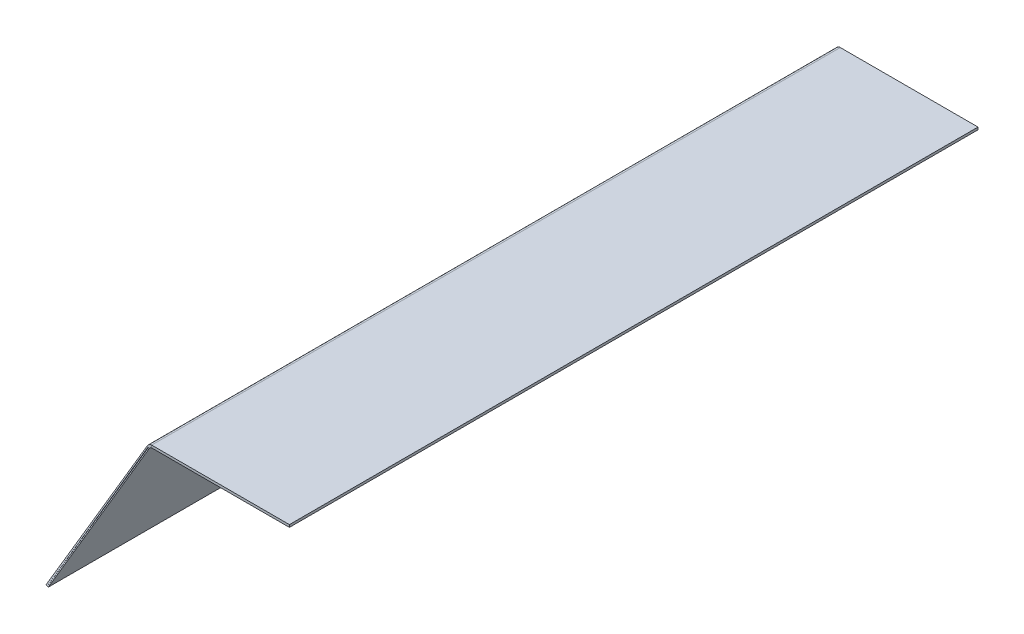
ISO-10303-21;
HEADER;
FILE_DESCRIPTION(('STEP AP214'),'2;1');
FILE_NAME('part.step','',(''),(''),'','','');
FILE_SCHEMA(('AUTOMOTIVE_DESIGN { 1 0 10303 214 1 1 1 1 }'));
ENDSEC;
DATA;
#1=APPLICATION_CONTEXT('core data for automotive mechanical design processes');
#2=APPLICATION_PROTOCOL_DEFINITION('international standard','automotive_design',2000,#1);
#3=PRODUCT_CONTEXT('',#1,'mechanical');
#4=PRODUCT('Part','Part','',(#3));
#5=PRODUCT_RELATED_PRODUCT_CATEGORY('part','',(#4));
#6=PRODUCT_DEFINITION_FORMATION('','',#4);
#7=PRODUCT_DEFINITION_CONTEXT('part definition',#1,'design');
#8=PRODUCT_DEFINITION('design','',#6,#7);
#9=PRODUCT_DEFINITION_SHAPE('','',#8);
#10=(LENGTH_UNIT() NAMED_UNIT(*) SI_UNIT(.MILLI.,.METRE.));
#11=(NAMED_UNIT(*) PLANE_ANGLE_UNIT() SI_UNIT($,.RADIAN.));
#12=(NAMED_UNIT(*) SI_UNIT($,.STERADIAN.) SOLID_ANGLE_UNIT());
#13=UNCERTAINTY_MEASURE_WITH_UNIT(LENGTH_MEASURE(1.E-05),#10,'distance_accuracy_value','');
#14=(GEOMETRIC_REPRESENTATION_CONTEXT(3) GLOBAL_UNCERTAINTY_ASSIGNED_CONTEXT((#13)) GLOBAL_UNIT_ASSIGNED_CONTEXT((#10,
#11,#12)) REPRESENTATION_CONTEXT('',''));
#15=CARTESIAN_POINT('',(0.,0.,0.));
#16=DIRECTION('',(0.,0.,1.));
#17=DIRECTION('',(1.,0.,0.));
#18=AXIS2_PLACEMENT_3D('',#15,#16,#17);
#19=CARTESIAN_POINT('',(-74.4010070551372,31.8162201222626,0.));
#20=DIRECTION('',(0.919457622666744,-0.393189114956173,0.));
#21=DIRECTION('',(0.393189114956173,0.919457622666744,0.));
#22=AXIS2_PLACEMENT_3D('',#19,#20,#21);
#23=PLANE('',#22);
#24=DIRECTION('',(0.,0.,1.));
#25=VECTOR('',#24,1.);
#26=CARTESIAN_POINT('',(-152.379906005456,-150.534435884636,-483.839715405722));
#27=LINE('',#26,#25);
#28=CARTESIAN_POINT('',(-152.379906005456,-150.534435884636,-483.839715405722));
#29=VERTEX_POINT('',#28);
#30=CARTESIAN_POINT('',(-152.379906005456,-150.534435884636,486.160284594278));
#31=VERTEX_POINT('',#30);
#32=EDGE_CURVE('E86',#29,#31,#27,.T.);
#33=ORIENTED_EDGE('',*,*,#32,.T.);
#34=DIRECTION('',(0.369516544423051,0.86410022695852,-0.341743063086704));
#35=VECTOR('',#34,1.);
#36=CARTESIAN_POINT('',(-88.2900802675994,-0.662843389956598,426.887557321551));
#37=LINE('',#36,#35);
#38=CARTESIAN_POINT('',(-88.2900802675994,-0.662843389956598,426.887557321551));
#39=VERTEX_POINT('',#38);
#40=EDGE_CURVE('E97',#31,#39,#37,.T.);
#41=ORIENTED_EDGE('',*,*,#40,.T.);
#42=DIRECTION('',(0.,0.,-1.));
#43=VECTOR('',#42,1.);
#44=CARTESIAN_POINT('',(-88.2900802675993,-0.662843389956709,-424.566988132994));
#45=LINE('',#44,#43);
#46=CARTESIAN_POINT('',(-88.2900802675993,-0.662843389956709,-424.566988132994));
#47=VERTEX_POINT('',#46);
#48=EDGE_CURVE('E82',#39,#47,#45,.T.);
#49=ORIENTED_EDGE('',*,*,#48,.T.);
#50=DIRECTION('',(-0.369516544423051,-0.86410022695852,-0.341743063086704));
#51=VECTOR('',#50,1.);
#52=CARTESIAN_POINT('',(-88.2900802675993,-0.662843389956709,-424.566988132994));
#53=LINE('',#52,#51);
#54=EDGE_CURVE('E14',#47,#29,#53,.T.);
#55=ORIENTED_EDGE('',*,*,#54,.T.);
#56=EDGE_LOOP('',(#33,#41,#49,#55));
#57=FACE_BOUND('',#56,.T.);
#58=ADVANCED_FACE('F77',(#57),#23,.F.);
#59=OPEN_SHELL('',(#58));
#60=SHELL_BASED_SURFACE_MODEL('B2',(#59));
#61=CARTESIAN_POINT('',(0.,0.,1.70234197109191E-13));
#62=DIRECTION('',(0.,1.,0.));
#63=DIRECTION('',(0.,0.,1.));
#64=AXIS2_PLACEMENT_3D('',#61,#62,#63);
#65=PLANE('',#64);
#66=DIRECTION('',(0.,0.,1.));
#67=VECTOR('',#66,1.);
#68=CARTESIAN_POINT('',(-85.,0.,425.));
#69=LINE('',#68,#67);
#70=CARTESIAN_POINT('',(-85.,1.23331324035327E-13,-425.));
#71=VERTEX_POINT('',#70);
#72=CARTESIAN_POINT('',(-85.,0.,425.));
#73=VERTEX_POINT('',#72);
#74=EDGE_CURVE('E124',#71,#73,#69,.T.);
#75=ORIENTED_EDGE('',*,*,#74,.F.);
#76=DIRECTION('',(-1.,0.,0.));
#77=VECTOR('',#76,1.);
#78=CARTESIAN_POINT('',(-85.,0.,-425.));
#79=LINE('',#78,#77);
#80=CARTESIAN_POINT('',(85.,0.,-425.));
#81=VERTEX_POINT('',#80);
#82=EDGE_CURVE('E197',#81,#71,#79,.T.);
#83=ORIENTED_EDGE('',*,*,#82,.F.);
#84=DIRECTION('',(0.,0.,-1.));
#85=VECTOR('',#84,1.);
#86=CARTESIAN_POINT('',(85.,0.,-425.));
#87=LINE('',#86,#85);
#88=CARTESIAN_POINT('',(85.0000000000001,0.,425.));
#89=VERTEX_POINT('',#88);
#90=EDGE_CURVE('E152',#89,#81,#87,.T.);
#91=ORIENTED_EDGE('',*,*,#90,.F.);
#92=DIRECTION('',(1.,0.,0.));
#93=VECTOR('',#92,1.);
#94=CARTESIAN_POINT('',(85.0000000000001,0.,425.));
#95=LINE('',#94,#93);
#96=EDGE_CURVE('E159',#73,#89,#95,.T.);
#97=ORIENTED_EDGE('',*,*,#96,.F.);
#98=EDGE_LOOP('',(#75,#83,#91,#97));
#99=FACE_BOUND('',#98,.T.);
#100=ADVANCED_FACE('F121',(#99),#65,.F.);
#101=CARTESIAN_POINT('',(85.0000000000001,0.,425.));
#102=DIRECTION('',(0.,0.,1.));
#103=DIRECTION('',(1.,0.,0.));
#104=AXIS2_PLACEMENT_3D('',#101,#102,#103);
#105=PLANE('',#104);
#106=ORIENTED_EDGE('',*,*,#96,.T.);
#107=DIRECTION('',(0.,1.,0.));
#108=VECTOR('',#107,1.);
#109=CARTESIAN_POINT('',(85.0000000000002,0.,425.));
#110=LINE('',#109,#108);
#111=CARTESIAN_POINT('',(85.0000000000001,3.,425.));
#112=VERTEX_POINT('',#111);
#113=EDGE_CURVE('E214',#112,#89,#110,.F.);
#114=ORIENTED_EDGE('',*,*,#113,.F.);
#115=DIRECTION('',(1.,0.,0.));
#116=VECTOR('',#115,1.);
#117=CARTESIAN_POINT('',(0.,3.,425.));
#118=LINE('',#117,#116);
#119=CARTESIAN_POINT('',(-85.,3.,425.));
#120=VERTEX_POINT('',#119);
#121=EDGE_CURVE('E220',#120,#112,#118,.T.);
#122=ORIENTED_EDGE('',*,*,#121,.F.);
#123=DIRECTION('',(0.,1.,0.));
#124=VECTOR('',#123,1.);
#125=CARTESIAN_POINT('',(-85.,0.,425.));
#126=LINE('',#125,#124);
#127=EDGE_CURVE('E206',#120,#73,#126,.F.);
#128=ORIENTED_EDGE('',*,*,#127,.T.);
#129=EDGE_LOOP('',(#106,#114,#122,#128));
#130=FACE_BOUND('',#129,.T.);
#131=ADVANCED_FACE('F218',(#130),#105,.T.);
#132=CARTESIAN_POINT('',(85.,0.,-425.));
#133=DIRECTION('',(1.,0.,0.));
#134=DIRECTION('',(0.,0.,-1.));
#135=AXIS2_PLACEMENT_3D('',#132,#133,#134);
#136=PLANE('',#135);
#137=ORIENTED_EDGE('',*,*,#90,.T.);
#138=DIRECTION('',(0.,1.,0.));
#139=VECTOR('',#138,1.);
#140=CARTESIAN_POINT('',(85.,0.,-425.));
#141=LINE('',#140,#139);
#142=CARTESIAN_POINT('',(85.,3.,-425.));
#143=VERTEX_POINT('',#142);
#144=EDGE_CURVE('E139',#143,#81,#141,.F.);
#145=ORIENTED_EDGE('',*,*,#144,.F.);
#146=DIRECTION('',(0.,0.,1.));
#147=VECTOR('',#146,1.);
#148=CARTESIAN_POINT('',(85.0000000000001,3.,1.70234197109191E-13));
#149=LINE('',#148,#147);
#150=EDGE_CURVE('E130',#112,#143,#149,.F.);
#151=ORIENTED_EDGE('',*,*,#150,.F.);
#152=ORIENTED_EDGE('',*,*,#113,.T.);
#153=EDGE_LOOP('',(#137,#145,#151,#152));
#154=FACE_BOUND('',#153,.T.);
#155=ADVANCED_FACE('F268',(#154),#136,.T.);
#156=CARTESIAN_POINT('',(-85.,0.,-425.));
#157=DIRECTION('',(0.,0.,-1.));
#158=DIRECTION('',(-1.,0.,0.));
#159=AXIS2_PLACEMENT_3D('',#156,#157,#158);
#160=PLANE('',#159);
#161=ORIENTED_EDGE('',*,*,#82,.T.);
#162=DIRECTION('',(0.,1.,0.));
#163=VECTOR('',#162,1.);
#164=CARTESIAN_POINT('',(-85.,0.,-425.));
#165=LINE('',#164,#163);
#166=CARTESIAN_POINT('',(-85.,3.00000000000012,-425.));
#167=VERTEX_POINT('',#166);
#168=EDGE_CURVE('E189',#71,#167,#165,.T.);
#169=ORIENTED_EDGE('',*,*,#168,.T.);
#170=DIRECTION('',(1.,0.,0.));
#171=VECTOR('',#170,1.);
#172=CARTESIAN_POINT('',(0.,3.,-425.));
#173=LINE('',#172,#171);
#174=EDGE_CURVE('E75',#143,#167,#173,.F.);
#175=ORIENTED_EDGE('',*,*,#174,.F.);
#176=ORIENTED_EDGE('',*,*,#144,.T.);
#177=EDGE_LOOP('',(#161,#169,#175,#176));
#178=FACE_BOUND('',#177,.T.);
#179=ADVANCED_FACE('F208',(#178),#160,.T.);
#180=CARTESIAN_POINT('',(0.,3.,1.70234197109191E-13));
#181=DIRECTION('',(0.,1.,0.));
#182=DIRECTION('',(0.,0.,1.));
#183=AXIS2_PLACEMENT_3D('',#180,#181,#182);
#184=PLANE('',#183);
#185=ORIENTED_EDGE('',*,*,#150,.T.);
#186=ORIENTED_EDGE('',*,*,#174,.T.);
#187=DIRECTION('',(0.,0.,1.));
#188=VECTOR('',#187,1.);
#189=CARTESIAN_POINT('',(-85.,3.,1.70234197109191E-13));
#190=LINE('',#189,#188);
#191=EDGE_CURVE('E166',#167,#120,#190,.T.);
#192=ORIENTED_EDGE('',*,*,#191,.T.);
#193=ORIENTED_EDGE('',*,*,#121,.T.);
#194=EDGE_LOOP('',(#185,#186,#192,#193));
#195=FACE_BOUND('',#194,.T.);
#196=ADVANCED_FACE('F267',(#195),#184,.T.);
#197=CARTESIAN_POINT('',(-85.,3.02999999999998,425.));
#198=CARTESIAN_POINT('',(-85.5474060731577,3.02999999999998,425.053036906436));
#199=CARTESIAN_POINT('',(-86.0946866329668,2.94961096625254,425.106068022598));
#200=CARTESIAN_POINT('',(-87.1432006777614,2.63480769044957,425.212136045196));
#201=CARTESIAN_POINT('',(-87.6442783192644,2.40043126854226,425.265170056494));
#202=CARTESIAN_POINT('',(-88.557983194433,1.79741700197734,425.371238079092));
#203=CARTESIAN_POINT('',(-88.9705006565159,1.42885160284587,425.424272090391));
#204=CARTESIAN_POINT('',(-89.6722132373853,0.588564593284675,425.530340112989));
#205=CARTESIAN_POINT('',(-89.9613123061872,0.116971403862222,425.58337122915));
#206=CARTESIAN_POINT('',(-90.1765464156137,-0.386345282796699,425.636408135587));
#207=CARTESIAN_POINT('',(-85.,2.99999999999998,425.));
#208=CARTESIAN_POINT('',(-85.5444891623684,2.99999999999998,425.053036905479));
#209=CARTESIAN_POINT('',(-86.0888534892743,2.92003932700075,425.106068022598));
#210=CARTESIAN_POINT('',(-87.131780425482,2.60691351092675,425.212136045196));
#211=CARTESIAN_POINT('',(-87.6301880262665,2.37378598647187,425.265170056494));
#212=CARTESIAN_POINT('',(-88.5390241365585,1.77398493979984,425.371238079092));
#213=CARTESIAN_POINT('',(-88.9493434594119,1.40738347707582,425.424272090391));
#214=CARTESIAN_POINT('',(-89.6473168968663,0.571574018187243,425.530340112989));
#215=CARTESIAN_POINT('',(-89.9348754750789,0.102493754553724,425.583371230107));
#216=CARTESIAN_POINT('',(-90.1489626869337,-0.398140956245384,425.636408135587));
#217=CARTESIAN_POINT('',(-85.,0.,425.));
#218=CARTESIAN_POINT('',(-85.2527980834438,0.,425.053036809763));
#219=CARTESIAN_POINT('',(-85.5055391200202,-0.037124598178232,425.106068022598));
#220=CARTESIAN_POINT('',(-85.9897551975452,-0.182504441355447,425.212136045196));
#221=CARTESIAN_POINT('',(-86.2211587264809,-0.29074222056664,425.265170056494));
#222=CARTESIAN_POINT('',(-86.6431183491165,-0.569221277950081,425.371238079092));
#223=CARTESIAN_POINT('',(-86.8336237490127,-0.739429099929096,425.424272090391));
#224=CARTESIAN_POINT('',(-87.1576828449737,-1.12748349155593,425.530340112989));
#225=CARTESIAN_POINT('',(-87.2911923642417,-1.34527117629606,425.583371325823));
#226=CARTESIAN_POINT('',(-87.3905898189335,-1.57770830111394,425.636408135587));
#227=CARTESIAN_POINT('',(-85.,-0.0303000000000178,425.));
#228=CARTESIAN_POINT('',(-85.2498520035467,-0.0303000000000191,425.053036808796));
#229=CARTESIAN_POINT('',(-85.4996476448907,-0.0669919538225398,425.106068022598));
#230=CARTESIAN_POINT('',(-85.978220742743,-0.210677562673497,425.212136045196));
#231=CARTESIAN_POINT('',(-86.206927530553,-0.317653955457729,425.265170056494));
#232=CARTESIAN_POINT('',(-86.6239697006633,-0.592887660749356,425.371238079092));
#233=CARTESIAN_POINT('',(-86.8122549799376,-0.761111906956845,425.424272090391));
#234=CARTESIAN_POINT('',(-87.1325375410495,-1.14464397240434,425.530340112989));
#235=CARTESIAN_POINT('',(-87.2644911648222,-1.35989360209765,425.58337132679));
#236=CARTESIAN_POINT('',(-87.3627302529667,-1.58962193129711,425.636408135587));
#237=B_SPLINE_SURFACE_WITH_KNOTS('',1,3,((#197,#198,#199,#200,#201,#202,#203,#204,#205,#206),
(#207,#208,#209,#210,#211,#212,#213,#214,#215,#216),(#217,#218,#219,#220,#221,#222,#223,#224,
#225,#226),(#227,#228,#229,#230,#231,#232,#233,#234,#235,#236)),.UNSPECIFIED.,.F.,.F.,.F.,(2,1,
1,2),(4,2,2,2,4),(-0.01,0.,1.,1.0101),(0.,0.25,0.5,0.75,1.),.UNSPECIFIED.);
#238=DIRECTION('',(0.919457622666744,-0.393189114956173,0.));
#239=VECTOR('',#238,1.);
#240=CARTESIAN_POINT('',(-90.1489626869338,-0.398140956245424,425.636408135587));
#241=LINE('',#240,#239);
#242=CARTESIAN_POINT('',(-87.3905898189335,-1.57770830111397,425.636408135587));
#243=VERTEX_POINT('',#242);
#244=CARTESIAN_POINT('',(-90.1489626869338,-0.398140956245455,425.636408135587));
#245=VERTEX_POINT('',#244);
#246=EDGE_CURVE('E225',#243,#245,#241,.F.);
#247=CARTESIAN_POINT('',(-85.,0.,425.));
#248=CARTESIAN_POINT('',(-85.0315981027957,2.74792040034967E-07,425.006629251412));
#249=CARTESIAN_POINT('',(-85.0631961882308,-0.000576012961313448,425.013258502825));
#250=CARTESIAN_POINT('',(-85.1263503702388,-0.0028797408908729,425.026517005649));
#251=CARTESIAN_POINT('',(-85.1579064668117,-0.00460718106707852,425.033146257062));
#252=CARTESIAN_POINT('',(-85.2209347169546,-0.00921124117437272,425.046404759886));
#253=CARTESIAN_POINT('',(-85.2524068705245,-0.0120878611054616,425.053034011299));
#254=CARTESIAN_POINT('',(-85.3152254070461,-0.0189863706657483,425.066292514124));
#255=CARTESIAN_POINT('',(-85.3465717899978,-0.0230082602949461,425.072921765536));
#256=CARTESIAN_POINT('',(-85.4090971208272,-0.0321919868271877,425.086180268361));
#257=CARTESIAN_POINT('',(-85.4402760687048,-0.037353823730231,425.092809519773));
#258=CARTESIAN_POINT('',(-85.5024250885478,-0.04881057780612,425.106068022598));
#259=CARTESIAN_POINT('',(-85.5333951605132,-0.0551054949789661,425.11269727401));
#260=CARTESIAN_POINT('',(-85.5950852650303,-0.0688200444595399,425.125955776835));
#261=CARTESIAN_POINT('',(-85.6258052975821,-0.0762396767672677,425.132585028247));
#262=CARTESIAN_POINT('',(-85.686954492184,-0.092193794369885,425.145843531072));
#263=CARTESIAN_POINT('',(-85.7173836542343,-0.100728279664774,425.152472782484));
#264=CARTESIAN_POINT('',(-85.7779106633312,-0.118900759868904,425.165731285309));
#265=CARTESIAN_POINT('',(-85.8080085103778,-0.128538754778146,425.172360536721));
#266=CARTESIAN_POINT('',(-85.8678328853338,-0.148905443971971,425.185619039546));
#267=CARTESIAN_POINT('',(-85.8975594132431,-0.159634138256556,425.192248290958));
#268=CARTESIAN_POINT('',(-85.9566016393228,-0.182167966314828,425.205506793783));
#269=CARTESIAN_POINT('',(-85.9859173374932,-0.193973100088515,425.212136045196));
#270=CARTESIAN_POINT('',(-86.0440989395425,-0.218644116493245,425.22539454802));
#271=CARTESIAN_POINT('',(-86.0729648434214,-0.231509999124288,425.232023799433));
#272=CARTESIAN_POINT('',(-86.1302084901729,-0.258285412735336,425.245282302257));
#273=CARTESIAN_POINT('',(-86.1585862330454,-0.27219494371534,425.25191155367));
#274=CARTESIAN_POINT('',(-86.2148158399018,-0.301039166364421,425.265170056494));
#275=CARTESIAN_POINT('',(-86.2426677038856,-0.315973858033499,425.271799307907));
#276=CARTESIAN_POINT('',(-86.2978085340467,-0.346848551822972,425.285057810731));
#277=CARTESIAN_POINT('',(-86.325097500224,-0.362788553943368,425.291687062144));
#278=CARTESIAN_POINT('',(-86.3790762640221,-0.39565268220327,425.304945564969));
#279=CARTESIAN_POINT('',(-86.4057660616429,-0.412576808342777,425.311574816381));
#280=CARTESIAN_POINT('',(-86.4585110139545,-0.447386690173942,425.324833319206));
#281=CARTESIAN_POINT('',(-86.4845661686453,-0.465272445865601,425.331462570618));
#282=CARTESIAN_POINT('',(-86.5360072042503,-0.50198181419754,425.344721073443));
#283=CARTESIAN_POINT('',(-86.5613930851646,-0.520805426837822,425.351350324855));
#284=CARTESIAN_POINT('',(-86.6114618319258,-0.559365489924004,425.36460882768));
#285=CARTESIAN_POINT('',(-86.6361446977728,-0.579101940369903,425.371238079092));
#286=CARTESIAN_POINT('',(-86.6847746075116,-0.619461446638565,425.384496581917));
#287=CARTESIAN_POINT('',(-86.7087216514034,-0.640084502461327,425.391125833329));
#288=CARTESIAN_POINT('',(-86.7558480883512,-0.68218980863587,425.404384336154));
#289=CARTESIAN_POINT('',(-86.7790274814072,-0.70367205898765,425.411013587566));
#290=CARTESIAN_POINT('',(-86.8245878081159,-0.747467201385584,425.424272090391));
#291=CARTESIAN_POINT('',(-86.8469687417687,-0.769780093431738,425.430901341803));
#292=CARTESIAN_POINT('',(-86.8909024023621,-0.815206862349143,425.444159844628));
#293=CARTESIAN_POINT('',(-86.9124551293027,-0.838320739220394,425.450789096041));
#294=CARTESIAN_POINT('',(-86.9547037299722,-0.885318756296246,425.464047598865));
#295=CARTESIAN_POINT('',(-86.975399603701,-0.909202896500846,425.470676850278));
#296=CARTESIAN_POINT('',(-87.0159069902853,-0.957709694984185,425.483935353102));
#297=CARTESIAN_POINT('',(-87.0357185031406,-0.982332353262924,425.490564604515));
#298=CARTESIAN_POINT('',(-87.074430835889,-1.03228346097955,425.503823107339));
#299=CARTESIAN_POINT('',(-87.0933316557822,-1.05761191041743,425.510452358752));
#300=CARTESIAN_POINT('',(-87.1301974804402,-1.10894093568651,425.523710861577));
#301=CARTESIAN_POINT('',(-87.148162485205,-1.1349415115177,425.530340112989));
#302=CARTESIAN_POINT('',(-87.1831328031786,-1.18758023055826,425.543598615814));
#303=CARTESIAN_POINT('',(-87.2001381163873,-1.21421837376763,425.550227867226));
#304=CARTESIAN_POINT('',(-87.233166443243,-1.26809682450122,425.563486370051));
#305=CARTESIAN_POINT('',(-87.24918945689,-1.29533713202545,425.570115621463));
#306=CARTESIAN_POINT('',(-87.280231908868,-1.3503836954065,425.583374124288));
#307=CARTESIAN_POINT('',(-87.2952513471991,-1.37818995126333,425.5900033757));
#308=CARTESIAN_POINT('',(-87.3242666072509,-1.43433148998172,425.603261878525));
#309=CARTESIAN_POINT('',(-87.3382624289715,-1.46266677284329,425.609891129937));
#310=CARTESIAN_POINT('',(-87.3652121461064,-1.51982856614811,425.623149632762));
#311=CARTESIAN_POINT('',(-87.3781660415206,-1.54865507659136,425.629778884174));
#312=CARTESIAN_POINT('',(-87.3905898189335,-1.57770830111394,425.636408135587));
#313=B_SPLINE_CURVE_WITH_KNOTS('',3,(#247,#248,#249,#250,#251,#252,#253,#254,#255,#256,#257,
#258,#259,#260,#261,#262,#263,#264,#265,#266,#267,#268,#269,#270,#271,#272,#273,#274,#275,#276,
#277,#278,#279,#280,#281,#282,#283,#284,#285,#286,#287,#288,#289,#290,#291,#292,#293,#294,#295,
#296,#297,#298,#299,#300,#301,#302,#303,#304,#305,#306,#307,#308,#309,#310,#311,#312),
.UNSPECIFIED.,.F.,.F.,(4,2,2,2,2,2,2,2,2,2,2,2,2,2,2,2,2,2,2,2,2,2,2,2,2,2,2,2,2,2,2,2,4),(0.,
0.096852892492617,0.193705784985204,0.290558677477816,0.387411569970432,0.484264462463015,
0.581117354955632,0.677970247448268,0.774823139940862,0.871676032433449,0.968528924926082,
1.06538181741867,1.16223470991129,1.25908760240389,1.35594049489649,1.45279338738913,
1.54964627988172,1.64649917237431,1.74335206486694,1.84020495735953,1.93705784985214,
2.03391074234476,2.13076363483735,2.22761652732996,2.32446941982257,2.42132231231518,
2.5181752048078,2.61502809730039,2.711880989793,2.80873388228561,2.90558677477823,
3.00243966727082,3.09929255976343),.UNSPECIFIED.);
#314=EDGE_CURVE('E202',#73,#243,#313,.T.);
#315=CARTESIAN_POINT('',(-85.,2.99999999999998,425.));
#316=CARTESIAN_POINT('',(-85.0680574521754,3.0000005918598,425.006629251412));
#317=CARTESIAN_POINT('',(-85.1361148669587,2.99875935669873,425.013258502825));
#318=CARTESIAN_POINT('',(-85.2721392589759,2.99379748115814,425.026517005649));
#319=CARTESIAN_POINT('',(-85.3401062362099,2.99007684077862,425.033146257062));
#320=CARTESIAN_POINT('',(-85.4758593903637,2.98016040362445,425.046404759886));
#321=CARTESIAN_POINT('',(-85.5436455672836,2.9739646068498,425.053034011299));
#322=CARTESIAN_POINT('',(-85.6789470305609,2.9591062785661,425.066292514124));
#323=CARTESIAN_POINT('',(-85.7464623169184,2.95044374705706,425.072921765536));
#324=CARTESIAN_POINT('',(-85.8811322602432,2.93066341298762,425.086180268361));
#325=CARTESIAN_POINT('',(-85.9482869172104,2.91954561042722,425.092809519773));
#326=CARTESIAN_POINT('',(-86.0821463445646,2.8948695247253,425.106068022598));
#327=CARTESIAN_POINT('',(-86.1488511149516,2.88131124158379,425.11269727401));
#328=CARTESIAN_POINT('',(-86.2817221092961,2.85177221193332,425.125955776835));
#329=CARTESIAN_POINT('',(-86.3478883332537,2.83579146542436,425.132585028247));
#330=CARTESIAN_POINT('',(-86.4795942908579,2.80142875058796,425.145843531072));
#331=CARTESIAN_POINT('',(-86.5451340245045,2.7830467822605,425.152472782484));
#332=CARTESIAN_POINT('',(-86.6754998902517,2.743906055667,425.165731285309));
#333=CARTESIAN_POINT('',(-86.7403260223522,2.72314729740094,425.172360536721));
#334=CARTESIAN_POINT('',(-86.8691785222574,2.67928058221424,425.185619039546));
#335=CARTESIAN_POINT('',(-86.9332048900621,2.65617262529359,425.192248290958));
#336=CARTESIAN_POINT('',(-87.0603727616185,2.60763822639885,425.205506793783));
#337=CARTESIAN_POINT('',(-87.1235142653701,2.58221178442476,425.212136045196));
#338=CARTESIAN_POINT('',(-87.2488284851685,2.52907421062996,425.22539454802));
#339=CARTESIAN_POINT('',(-87.3110012012154,2.50136307880924,425.232023799433));
#340=CARTESIAN_POINT('',(-87.4342952096031,2.44369295718545,425.245282302257));
#341=CARTESIAN_POINT('',(-87.495416501944,2.41373396738237,425.25191155367));
#342=CARTESIAN_POINT('',(-87.6165264244039,2.35160794936896,425.265170056494));
#343=CARTESIAN_POINT('',(-87.6765150545229,2.31944092115864,425.271799307907));
#344=CARTESIAN_POINT('',(-87.7952799194853,2.25294158068901,425.285057810731));
#345=CARTESIAN_POINT('',(-87.8540561543287,2.21860926842969,425.291687062144));
#346=CARTESIAN_POINT('',(-87.9703181071245,2.14782499217759,425.304945564969));
#347=CARTESIAN_POINT('',(-88.027803825077,2.1113730281848,425.311574816381));
#348=CARTESIAN_POINT('',(-88.1414083377481,2.03639789808692,425.324833319206));
#349=CARTESIAN_POINT('',(-88.1975271324667,1.99787473198181,425.331462570618));
#350=CARTESIAN_POINT('',(-88.3083232091546,1.91880840018994,425.344721073443));
#351=CARTESIAN_POINT('',(-88.3630004911237,1.87826523450317,425.351350324855));
#352=CARTESIAN_POINT('',(-88.4708408687633,1.79521279093293,425.36460882768));
#353=CARTESIAN_POINT('',(-88.5240039644337,1.75270351304946,425.371238079092));
#354=CARTESIAN_POINT('',(-88.6287453084865,1.66577534570158,425.384496581917));
#355=CARTESIAN_POINT('',(-88.6803235568688,1.62135645623717,425.391125833329));
#356=CARTESIAN_POINT('',(-88.7818266518333,1.53066810447661,425.404384336154));
#357=CARTESIAN_POINT('',(-88.8317514984155,1.48439864218046,425.411013587566));
#358=CARTESIAN_POINT('',(-88.9298814328651,1.39007064316953,425.424272090391));
#359=CARTESIAN_POINT('',(-88.9780865207325,1.34201210645474,425.430901341803));
#360=CARTESIAN_POINT('',(-89.072712866626,1.24416983494034,425.444159844628));
#361=CARTESIAN_POINT('',(-89.1191341246519,1.19438610014072,425.450789096041));
#362=CARTESIAN_POINT('',(-89.2101311107093,1.09315960182349,425.464047598865));
#363=CARTESIAN_POINT('',(-89.2547068387407,1.04171683830589,425.470676850278));
#364=CARTESIAN_POINT('',(-89.3419535175375,0.937240656957166,425.483935353102));
#365=CARTESIAN_POINT('',(-89.3846244683028,0.884207239126039,425.490564604515));
#366=CARTESIAN_POINT('',(-89.4680048772995,0.776620237890228,425.503823107339));
#367=CARTESIAN_POINT('',(-89.5087143355309,0.722066654485544,425.510452358752));
#368=CARTESIAN_POINT('',(-89.5881176501789,0.61151183082907,425.523710861577));
#369=CARTESIAN_POINT('',(-89.6268115065955,0.555510590577281,425.530340112989));
#370=CARTESIAN_POINT('',(-89.7021321914616,0.442134888028387,425.543598615814));
#371=CARTESIAN_POINT('',(-89.7387590199112,0.384760425731281,425.550227867226));
#372=CARTESIAN_POINT('',(-89.8098969546773,0.268714531843544,425.563486370051));
#373=CARTESIAN_POINT('',(-89.8444080609938,0.210043100252912,425.570115621463));
#374=CARTESIAN_POINT('',(-89.9112687267926,0.0914812714321782,425.583374124288));
#375=CARTESIAN_POINT('',(-89.9436182862749,0.0315908742020766,425.5900033757));
#376=CARTESIAN_POINT('',(-90.0061126925403,-0.0893293630375388,425.603261878525));
#377=CARTESIAN_POINT('',(-90.0362575393233,-0.150359203047052,425.609891129937));
#378=CARTESIAN_POINT('',(-90.0943030839215,-0.273476911703577,425.623149632762));
#379=CARTESIAN_POINT('',(-90.1222037817367,-0.335564780350587,425.629778884174));
#380=CARTESIAN_POINT('',(-90.1489626869337,-0.398140956245384,425.636408135587));
#381=B_SPLINE_CURVE_WITH_KNOTS('',3,(#315,#316,#317,#318,#319,#320,#321,#322,#323,#324,#325,
#326,#327,#328,#329,#330,#331,#332,#333,#334,#335,#336,#337,#338,#339,#340,#341,#342,#343,#344,
#345,#346,#347,#348,#349,#350,#351,#352,#353,#354,#355,#356,#357,#358,#359,#360,#361,#362,#363,
#364,#365,#366,#367,#368,#369,#370,#371,#372,#373,#374,#375,#376,#377,#378,#379,#380),
.UNSPECIFIED.,.F.,.F.,(4,2,2,2,2,2,2,2,2,2,2,2,2,2,2,2,2,2,2,2,2,2,2,2,2,2,2,2,2,2,2,2,4),(0.,
0.205127352563989,0.410254705127977,0.615382057691963,0.820509410255951,1.02563676281994,
1.23076411538393,1.43589146794793,1.6410188205119,1.84614617307589,2.05127352563989,
2.25640087820386,2.46152823076786,2.66665558333185,2.87178293589583,3.07691028845983,
3.28203764102381,3.48716499358779,3.6922923461518,3.89741969871577,4.10254705127976,
4.30767440384375,4.51280175640773,4.71792910897172,4.92305646153571,5.12818381409971,
5.3333111666637,5.53843851922768,5.74356587179167,5.94869322435566,6.15382057691965,
6.35894792948363,6.56407528204762),.UNSPECIFIED.);
#382=EDGE_CURVE('E207',#120,#245,#381,.T.);
#383=ORIENTED_EDGE('',*,*,#246,.F.);
#384=ORIENTED_EDGE('',*,*,#314,.F.);
#385=ORIENTED_EDGE('',*,*,#127,.F.);
#386=ORIENTED_EDGE('',*,*,#382,.T.);
#387=EDGE_LOOP('',(#383,#384,#385,#386));
#388=FACE_BOUND('',#387,.T.);
#389=ADVANCED_FACE('F223',(#388),#237,.F.);
#390=CARTESIAN_POINT('',(-90.1765464156138,-0.386345282796603,-425.61226127099));
#391=CARTESIAN_POINT('',(-89.9613122980905,0.116971422796239,-425.561236711234));
#392=CARTESIAN_POINT('',(-89.6722132373853,0.588564593284788,-425.510217725825));
#393=CARTESIAN_POINT('',(-88.9705006565159,1.428851602846,-425.40817418066));
#394=CARTESIAN_POINT('',(-88.5579831944329,1.79741700197749,-425.357152408077));
#395=CARTESIAN_POINT('',(-87.6442783192643,2.40043126854241,-425.255108862912));
#396=CARTESIAN_POINT('',(-87.1432006777613,2.63480769044972,-425.20408709033));
#397=CARTESIAN_POINT('',(-86.0946866329668,2.94961096625269,-425.102043545165));
#398=CARTESIAN_POINT('',(-85.5474060937501,3.03000000000013,-425.051024559756));
#399=CARTESIAN_POINT('',(-85.,3.03000000000012,-425.));
#400=CARTESIAN_POINT('',(-90.1489626869338,-0.398140956245289,-425.61226127099));
#401=CARTESIAN_POINT('',(-89.9348754668988,0.102493773682598,-425.56123671209));
#402=CARTESIAN_POINT('',(-89.6473168968664,0.571574018187356,-425.510217725825));
#403=CARTESIAN_POINT('',(-88.9493434594119,1.40738347707595,-425.40817418066));
#404=CARTESIAN_POINT('',(-88.5390241365585,1.77398493979999,-425.357152408077));
#405=CARTESIAN_POINT('',(-87.6301880262665,2.37378598647203,-425.255108862912));
#406=CARTESIAN_POINT('',(-87.131780425482,2.6069135109269,-425.20408709033));
#407=CARTESIAN_POINT('',(-86.0888534892743,2.9200393270009,-425.102043545165));
#408=CARTESIAN_POINT('',(-85.5444891831728,3.00000000000013,-425.0510245589));
#409=CARTESIAN_POINT('',(-85.,3.00000000000012,-425.));
#410=CARTESIAN_POINT('',(-87.3905898189335,-1.57770830111382,-425.61226127099));
#411=CARTESIAN_POINT('',(-87.2911923477289,-1.34527113768145,-425.561236797647));
#412=CARTESIAN_POINT('',(-87.1576828449737,-1.1274834915558,-425.510217725825));
#413=CARTESIAN_POINT('',(-86.8336237490127,-0.739429099928958,-425.40817418066));
#414=CARTESIAN_POINT('',(-86.6431183491164,-0.56922127794994,-425.357152408077));
#415=CARTESIAN_POINT('',(-86.2211587264809,-0.290742220566494,-425.255108862912));
#416=CARTESIAN_POINT('',(-85.9897551975452,-0.182504441355301,-425.20408709033));
#417=CARTESIAN_POINT('',(-85.5055391200202,-0.0371245981780866,-425.102043545165));
#418=CARTESIAN_POINT('',(-85.2527981254407,1.24521026812854E-13,-425.051024473343));
#419=CARTESIAN_POINT('',(-85.,1.23165366794353E-13,-425.));
#420=CARTESIAN_POINT('',(-87.3627302529667,-1.58962193129699,-425.61226127099));
#421=CARTESIAN_POINT('',(-87.2644911482253,-1.35989356328623,-425.561236798511));
#422=CARTESIAN_POINT('',(-87.1325375410496,-1.14464397240421,-425.510217725825));
#423=CARTESIAN_POINT('',(-86.8122549799376,-0.761111906956708,-425.40817418066));
#424=CARTESIAN_POINT('',(-86.6239697006633,-0.592887660749215,-425.357152408077));
#425=CARTESIAN_POINT('',(-86.206927530553,-0.317653955457583,-425.255108862912));
#426=CARTESIAN_POINT('',(-85.978220742743,-0.210677562673351,-425.20408709033));
#427=CARTESIAN_POINT('',(-85.4996476448907,-0.0669919538223943,-425.102043545165));
#428=CARTESIAN_POINT('',(-85.2498520457576,-0.0302999999998755,-425.051024472479));
#429=CARTESIAN_POINT('',(-85.,-0.0302999999998768,-425.));
#430=B_SPLINE_SURFACE_WITH_KNOTS('',1,3,((#390,#391,#392,#393,#394,#395,#396,#397,#398,#399),
(#400,#401,#402,#403,#404,#405,#406,#407,#408,#409),(#410,#411,#412,#413,#414,#415,#416,#417,
#418,#419),(#420,#421,#422,#423,#424,#425,#426,#427,#428,#429)),.UNSPECIFIED.,.F.,.F.,.F.,(2,1,
1,2),(4,2,2,2,4),(-0.01,0.,1.,1.0101),(0.,0.25,0.5,0.75,1.),.UNSPECIFIED.);
#431=CARTESIAN_POINT('',(-87.3905898189335,-1.57770830111382,-425.61226127099));
#432=CARTESIAN_POINT('',(-87.3781660415206,-1.54865507659123,-425.605883549417));
#433=CARTESIAN_POINT('',(-87.3652121461064,-1.51982856614798,-425.599505827844));
#434=CARTESIAN_POINT('',(-87.3382624289715,-1.46266677284316,-425.586750384699));
#435=CARTESIAN_POINT('',(-87.3242666072509,-1.43433148998161,-425.580372663126));
#436=CARTESIAN_POINT('',(-87.2952513471991,-1.37818995126321,-425.56761721998));
#437=CARTESIAN_POINT('',(-87.280231908868,-1.35038369540637,-425.561239498407));
#438=CARTESIAN_POINT('',(-87.24918945689,-1.29533713202532,-425.548484055262));
#439=CARTESIAN_POINT('',(-87.233166443243,-1.2680968245011,-425.542106333689));
#440=CARTESIAN_POINT('',(-87.2001381163873,-1.2142183737675,-425.529350890543));
#441=CARTESIAN_POINT('',(-87.1831328031786,-1.18758023055813,-425.522973168971));
#442=CARTESIAN_POINT('',(-87.148162485205,-1.13494151151757,-425.510217725825));
#443=CARTESIAN_POINT('',(-87.1301974804402,-1.10894093568639,-425.503840004252));
#444=CARTESIAN_POINT('',(-87.0933316557822,-1.05761191041731,-425.491084561107));
#445=CARTESIAN_POINT('',(-87.074430835889,-1.03228346097942,-425.484706839534));
#446=CARTESIAN_POINT('',(-87.0357185031406,-0.982332353262787,-425.471951396388));
#447=CARTESIAN_POINT('',(-87.0159069902853,-0.95770969498405,-425.465573674815));
#448=CARTESIAN_POINT('',(-86.9753996037011,-0.909202896500713,-425.45281823167));
#449=CARTESIAN_POINT('',(-86.9547037299722,-0.885318756296112,-425.446440510097));
#450=CARTESIAN_POINT('',(-86.9124551293027,-0.838320739220258,-425.433685066951));
#451=CARTESIAN_POINT('',(-86.8909024023621,-0.815206862349005,-425.427307345378));
#452=CARTESIAN_POINT('',(-86.8469687417687,-0.769780093431599,-425.414551902233));
#453=CARTESIAN_POINT('',(-86.8245878081159,-0.747467201385447,-425.40817418066));
#454=CARTESIAN_POINT('',(-86.7790274814072,-0.703672058987514,-425.395418737514));
#455=CARTESIAN_POINT('',(-86.7558480883512,-0.682189808635734,-425.389041015941));
#456=CARTESIAN_POINT('',(-86.7087216514034,-0.640084502461187,-425.376285572796));
#457=CARTESIAN_POINT('',(-86.6847746075116,-0.61946144663842,-425.369907851223));
#458=CARTESIAN_POINT('',(-86.6361446977728,-0.579101940369761,-425.357152408077));
#459=CARTESIAN_POINT('',(-86.6114618319258,-0.559365489923869,-425.350774686505));
#460=CARTESIAN_POINT('',(-86.5613930851646,-0.520805426837685,-425.338019243359));
#461=CARTESIAN_POINT('',(-86.5360072042503,-0.501981814197393,-425.331641521786));
#462=CARTESIAN_POINT('',(-86.4845661686453,-0.46527244586545,-425.318886078641));
#463=CARTESIAN_POINT('',(-86.4585110139544,-0.4473866901738,-425.312508357068));
#464=CARTESIAN_POINT('',(-86.4057660616429,-0.41257680834264,-425.299752913922));
#465=CARTESIAN_POINT('',(-86.3790762640221,-0.395652682203131,-425.293375192349));
#466=CARTESIAN_POINT('',(-86.325097500224,-0.362788553943224,-425.280619749204));
#467=CARTESIAN_POINT('',(-86.2978085340467,-0.346848551822826,-425.274242027631));
#468=CARTESIAN_POINT('',(-86.2426677038856,-0.315973858033352,-425.261486584485));
#469=CARTESIAN_POINT('',(-86.2148158399018,-0.301039166364276,-425.255108862912));
#470=CARTESIAN_POINT('',(-86.1585862330454,-0.272194943715197,-425.242353419767));
#471=CARTESIAN_POINT('',(-86.1302084901729,-0.258285412735193,-425.235975698194));
#472=CARTESIAN_POINT('',(-86.0729648434214,-0.231509999124143,-425.223220255048));
#473=CARTESIAN_POINT('',(-86.0440989395425,-0.218644116493097,-425.216842533476));
#474=CARTESIAN_POINT('',(-85.9859173374932,-0.193973100088367,-425.20408709033));
#475=CARTESIAN_POINT('',(-85.9566016393228,-0.182167966314684,-425.197709368757));
#476=CARTESIAN_POINT('',(-85.8975594132431,-0.159634138256413,-425.184953925612));
#477=CARTESIAN_POINT('',(-85.8678328853338,-0.148905443971825,-425.178576204039));
#478=CARTESIAN_POINT('',(-85.8080085103778,-0.128538754777997,-425.165820760893));
#479=CARTESIAN_POINT('',(-85.7779106633311,-0.118900759868757,-425.15944303932));
#480=CARTESIAN_POINT('',(-85.7173836542342,-0.100728279664629,-425.146687596175));
#481=CARTESIAN_POINT('',(-85.686954492184,-0.0921937943697419,-425.140309874602));
#482=CARTESIAN_POINT('',(-85.6258052975821,-0.0762396767671249,-425.127554431456));
#483=CARTESIAN_POINT('',(-85.5950852650303,-0.0688200444593949,-425.121176709883));
#484=CARTESIAN_POINT('',(-85.5333951605132,-0.055105494978819,-425.108421266738));
#485=CARTESIAN_POINT('',(-85.5024250885478,-0.0488105778059734,-425.102043545165));
#486=CARTESIAN_POINT('',(-85.4402760687048,-0.0373538237300856,-425.089288102019));
#487=CARTESIAN_POINT('',(-85.4090971208272,-0.0321919868270434,-425.082910380447));
#488=CARTESIAN_POINT('',(-85.3465717899978,-0.0230082602948027,-425.070154937301));
#489=CARTESIAN_POINT('',(-85.3152254070461,-0.0189863706656042,-425.063777215728));
#490=CARTESIAN_POINT('',(-85.2524068705245,-0.0120878611053172,-425.051021772582));
#491=CARTESIAN_POINT('',(-85.2209347169545,-0.00921124117422851,-425.04464405101));
#492=CARTESIAN_POINT('',(-85.1579064668117,-0.00460718106693482,-425.031888607864));
#493=CARTESIAN_POINT('',(-85.1263503702388,-0.00287974089072993,-425.025510886291));
#494=CARTESIAN_POINT('',(-85.0631961882308,-0.000576012961172328,-425.012755443146));
#495=CARTESIAN_POINT('',(-85.0315981027957,2.74792180429158E-07,-425.006377721573));
#496=CARTESIAN_POINT('',(-85.,1.23165366794353E-13,-425.));
#497=B_SPLINE_CURVE_WITH_KNOTS('',3,(#431,#432,#433,#434,#435,#436,#437,#438,#439,#440,#441,
#442,#443,#444,#445,#446,#447,#448,#449,#450,#451,#452,#453,#454,#455,#456,#457,#458,#459,#460,
#461,#462,#463,#464,#465,#466,#467,#468,#469,#470,#471,#472,#473,#474,#475,#476,#477,#478,#479,
#480,#481,#482,#483,#484,#485,#486,#487,#488,#489,#490,#491,#492,#493,#494,#495,#496),
.UNSPECIFIED.,.F.,.F.,(4,2,2,2,2,2,2,2,2,2,2,2,2,2,2,2,2,2,2,2,2,2,2,2,2,2,2,2,2,2,2,2,4),(0.,
0.0967007652903146,0.193401530580638,0.290102295870946,0.386803061161268,0.48350382645158,
0.580204591741904,0.676905357032216,0.773606122322535,0.870306887612855,0.967007652903173,
1.06370841819349,1.16040918348381,1.25710994877412,1.35381071406444,1.45051147935475,
1.54721224464508,1.64391300993538,1.7406137752257,1.83731454051602,1.93401530580633,
2.03071607109665,2.12741683638697,2.22411760167729,2.3208183669676,2.41751913225792,
2.51421989754823,2.61092066283856,2.70762142812887,2.8043221934192,2.9010229587095,
2.99772372399982,3.09442448929014),.UNSPECIFIED.);
#498=CARTESIAN_POINT('',(-87.3905898189335,-1.57770830111383,-425.61226127099));
#499=VERTEX_POINT('',#498);
#500=EDGE_CURVE('E192',#499,#71,#497,.T.);
#501=DIRECTION('',(0.919457622666744,-0.393189114956173,0.));
#502=VECTOR('',#501,1.);
#503=CARTESIAN_POINT('',(-87.3905898189334,-1.57770830111392,-425.61226127099));
#504=LINE('',#503,#502);
#505=CARTESIAN_POINT('',(-90.1489626869338,-0.398140956245376,-425.61226127099));
#506=VERTEX_POINT('',#505);
#507=EDGE_CURVE('E457',#499,#506,#504,.F.);
#508=CARTESIAN_POINT('',(-90.1489626869338,-0.398140956245287,-425.61226127099));
#509=CARTESIAN_POINT('',(-90.1222037817368,-0.335564780350479,-425.605883549417));
#510=CARTESIAN_POINT('',(-90.0943030839216,-0.273476911703471,-425.599505827844));
#511=CARTESIAN_POINT('',(-90.0362575393233,-0.150359203046951,-425.586750384699));
#512=CARTESIAN_POINT('',(-90.0061126925403,-0.0893293630374394,-425.580372663126));
#513=CARTESIAN_POINT('',(-89.943618286275,0.03159087420218,-425.56761721998));
#514=CARTESIAN_POINT('',(-89.9112687267926,0.0914812714322881,-425.561239498407));
#515=CARTESIAN_POINT('',(-89.8444080609938,0.210043100253025,-425.548484055262));
#516=CARTESIAN_POINT('',(-89.8098969546773,0.268714531843653,-425.542106333689));
#517=CARTESIAN_POINT('',(-89.7387590199112,0.384760425731392,-425.529350890543));
#518=CARTESIAN_POINT('',(-89.7021321914616,0.442134888028503,-425.522973168971));
#519=CARTESIAN_POINT('',(-89.6268115065955,0.5555105905774,-425.510217725825));
#520=CARTESIAN_POINT('',(-89.5881176501789,0.611511830829185,-425.503840004252));
#521=CARTESIAN_POINT('',(-89.5087143355309,0.722066654485661,-425.491084561107));
#522=CARTESIAN_POINT('',(-89.4680048772995,0.77662023789035,-425.484706839534));
#523=CARTESIAN_POINT('',(-89.3846244683028,0.884207239126164,-425.471951396388));
#524=CARTESIAN_POINT('',(-89.3419535175375,0.937240656957289,-425.465573674815));
#525=CARTESIAN_POINT('',(-89.2547068387408,1.04171683830602,-425.45281823167));
#526=CARTESIAN_POINT('',(-89.2101311107093,1.09315960182362,-425.446440510097));
#527=CARTESIAN_POINT('',(-89.1191341246519,1.19438610014085,-425.433685066951));
#528=CARTESIAN_POINT('',(-89.072712866626,1.24416983494047,-425.427307345378));
#529=CARTESIAN_POINT('',(-88.9780865207326,1.34201210645488,-425.414551902233));
#530=CARTESIAN_POINT('',(-88.9298814328651,1.39007064316966,-425.40817418066));
#531=CARTESIAN_POINT('',(-88.8317514984155,1.4843986421806,-425.395418737514));
#532=CARTESIAN_POINT('',(-88.7818266518333,1.53066810447674,-425.389041015941));
#533=CARTESIAN_POINT('',(-88.6803235568688,1.62135645623731,-425.376285572796));
#534=CARTESIAN_POINT('',(-88.6287453084865,1.66577534570172,-425.369907851223));
#535=CARTESIAN_POINT('',(-88.5240039644337,1.7527035130496,-425.357152408077));
#536=CARTESIAN_POINT('',(-88.4708408687633,1.79521279093307,-425.350774686505));
#537=CARTESIAN_POINT('',(-88.3630004911237,1.87826523450331,-425.338019243359));
#538=CARTESIAN_POINT('',(-88.3083232091546,1.91880840019008,-425.331641521786));
#539=CARTESIAN_POINT('',(-88.1975271324667,1.99787473198196,-425.318886078641));
#540=CARTESIAN_POINT('',(-88.1414083377481,2.03639789808706,-425.312508357068));
#541=CARTESIAN_POINT('',(-88.027803825077,2.11137302818495,-425.299752913922));
#542=CARTESIAN_POINT('',(-87.9703181071245,2.14782499217773,-425.293375192349));
#543=CARTESIAN_POINT('',(-87.8540561543287,2.21860926842983,-425.280619749204));
#544=CARTESIAN_POINT('',(-87.7952799194853,2.25294158068915,-425.274242027631));
#545=CARTESIAN_POINT('',(-87.6765150545229,2.31944092115879,-425.261486584485));
#546=CARTESIAN_POINT('',(-87.6165264244039,2.35160794936911,-425.255108862912));
#547=CARTESIAN_POINT('',(-87.495416501944,2.41373396738251,-425.242353419767));
#548=CARTESIAN_POINT('',(-87.4342952096031,2.4436929571856,-425.235975698194));
#549=CARTESIAN_POINT('',(-87.3110012012154,2.5013630788094,-425.223220255048));
#550=CARTESIAN_POINT('',(-87.2488284851685,2.52907421063011,-425.216842533476));
#551=CARTESIAN_POINT('',(-87.12351426537,2.58221178442491,-425.20408709033));
#552=CARTESIAN_POINT('',(-87.0603727616184,2.607638226399,-425.197709368757));
#553=CARTESIAN_POINT('',(-86.9332048900621,2.65617262529374,-425.184953925612));
#554=CARTESIAN_POINT('',(-86.8691785222574,2.67928058221439,-425.178576204039));
#555=CARTESIAN_POINT('',(-86.7403260223522,2.7231472974011,-425.165820760893));
#556=CARTESIAN_POINT('',(-86.6754998902517,2.74390605566715,-425.15944303932));
#557=CARTESIAN_POINT('',(-86.5451340245045,2.78304678226066,-425.146687596175));
#558=CARTESIAN_POINT('',(-86.4795942908579,2.80142875058811,-425.140309874602));
#559=CARTESIAN_POINT('',(-86.3478883332536,2.83579146542451,-425.127554431456));
#560=CARTESIAN_POINT('',(-86.2817221092961,2.85177221193347,-425.121176709883));
#561=CARTESIAN_POINT('',(-86.1488511149515,2.88131124158394,-425.108421266738));
#562=CARTESIAN_POINT('',(-86.0821463445645,2.89486952472545,-425.102043545165));
#563=CARTESIAN_POINT('',(-85.9482869172104,2.91954561042737,-425.089288102019));
#564=CARTESIAN_POINT('',(-85.8811322602431,2.93066341298776,-425.082910380447));
#565=CARTESIAN_POINT('',(-85.7464623169184,2.9504437470572,-425.070154937301));
#566=CARTESIAN_POINT('',(-85.6789470305608,2.95910627856625,-425.063777215728));
#567=CARTESIAN_POINT('',(-85.5436455672835,2.97396460684994,-425.051021772582));
#568=CARTESIAN_POINT('',(-85.4758593903637,2.9801604036246,-425.04464405101));
#569=CARTESIAN_POINT('',(-85.3401062362098,2.99007684077877,-425.031888607864));
#570=CARTESIAN_POINT('',(-85.2721392589759,2.99379748115829,-425.025510886291));
#571=CARTESIAN_POINT('',(-85.1361148669586,2.99875935669887,-425.012755443146));
#572=CARTESIAN_POINT('',(-85.0680574521754,3.00000059185994,-425.006377721573));
#573=CARTESIAN_POINT('',(-85.,3.00000000000012,-425.));
#574=B_SPLINE_CURVE_WITH_KNOTS('',3,(#508,#509,#510,#511,#512,#513,#514,#515,#516,#517,#518,
#519,#520,#521,#522,#523,#524,#525,#526,#527,#528,#529,#530,#531,#532,#533,#534,#535,#536,#537,
#538,#539,#540,#541,#542,#543,#544,#545,#546,#547,#548,#549,#550,#551,#552,#553,#554,#555,#556,
#557,#558,#559,#560,#561,#562,#563,#564,#565,#566,#567,#568,#569,#570,#571,#572,#573),
.UNSPECIFIED.,.F.,.F.,(4,2,2,2,2,2,2,2,2,2,2,2,2,2,2,2,2,2,2,2,2,2,2,2,2,2,2,2,2,2,2,2,4),(0.,
0.20505556806256,0.410111136125127,0.615166704187683,0.82022227225025,1.02527784031281,
1.23033340837538,1.43538897643793,1.6404445445005,1.84550011256306,2.05055568062562,
2.25561124868818,2.46066681675075,2.66572238481331,2.87077795287587,3.07583352093843,
3.280889089001,3.48594465706356,3.69100022512612,3.89605579318868,4.10111136125124,
4.30616692931381,4.51122249737637,4.71627806543893,4.92133363350149,5.12638920156407,
5.33144476962662,5.53650033768918,5.74155590575174,5.94661147381432,6.15166704187687,
6.35672260993944,6.56177817800199),.UNSPECIFIED.);
#575=EDGE_CURVE('E194',#506,#167,#574,.T.);
#576=ORIENTED_EDGE('',*,*,#500,.F.);
#577=ORIENTED_EDGE('',*,*,#507,.T.);
#578=ORIENTED_EDGE('',*,*,#575,.T.);
#579=ORIENTED_EDGE('',*,*,#168,.F.);
#580=EDGE_LOOP('',(#576,#577,#578,#579));
#581=FACE_BOUND('',#580,.T.);
#582=ADVANCED_FACE('F190',(#581),#430,.F.);
#583=CARTESIAN_POINT('',(-85.,-2.59999999999989,-425.61226127099));
#584=DIRECTION('',(0.,0.,-1.));
#585=DIRECTION('',(-0.919457622666744,0.393189114956173,0.));
#586=AXIS2_PLACEMENT_3D('',#583,#584,#585);
#587=CYLINDRICAL_SURFACE('',#586,5.60000000000001);
#588=ORIENTED_EDGE('',*,*,#191,.F.);
#589=ORIENTED_EDGE('',*,*,#575,.F.);
#590=DIRECTION('',(0.,0.,-1.));
#591=VECTOR('',#590,1.);
#592=CARTESIAN_POINT('',(-90.1489626869338,-0.398140956245416,425.636408135587));
#593=LINE('',#592,#591);
#594=EDGE_CURVE('E455',#506,#245,#593,.F.);
#595=ORIENTED_EDGE('',*,*,#594,.T.);
#596=ORIENTED_EDGE('',*,*,#382,.F.);
#597=EDGE_LOOP('',(#588,#589,#595,#596));
#598=FACE_BOUND('',#597,.T.);
#599=ADVANCED_FACE('F244',(#598),#587,.T.);
#600=CARTESIAN_POINT('',(-85.,-2.59999999999989,-425.61226127099));
#601=DIRECTION('',(0.,0.,-1.));
#602=DIRECTION('',(-0.919457622666744,0.393189114956173,0.));
#603=AXIS2_PLACEMENT_3D('',#600,#601,#602);
#604=CYLINDRICAL_SURFACE('',#603,2.60000000000001);
#605=ORIENTED_EDGE('',*,*,#74,.T.);
#606=ORIENTED_EDGE('',*,*,#314,.T.);
#607=DIRECTION('',(0.,0.,-1.));
#608=VECTOR('',#607,1.);
#609=CARTESIAN_POINT('',(-87.3905898189335,-1.57770830111395,425.636408135587));
#610=LINE('',#609,#608);
#611=EDGE_CURVE('E184',#243,#499,#610,.T.);
#612=ORIENTED_EDGE('',*,*,#611,.T.);
#613=ORIENTED_EDGE('',*,*,#500,.T.);
#614=EDGE_LOOP('',(#605,#606,#612,#613));
#615=FACE_BOUND('',#614,.T.);
#616=ADVANCED_FACE('F200',(#615),#604,.F.);
#617=CARTESIAN_POINT('',(-154.312380935127,-150.441826705866,-483.839715405722));
#618=DIRECTION('',(-0.132135773812507,-0.308994424915401,0.941839998434007));
#619=DIRECTION('',(0.,-0.950171456700867,-0.311727770451963));
#620=AXIS2_PLACEMENT_3D('',#617,#618,#619);
#621=PLANE('',#620);
#622=ORIENTED_EDGE('',*,*,#507,.F.);
#623=DIRECTION('',(0.370321235414591,0.865981965892583,0.336061627309381));
#624=VECTOR('',#623,1.);
#625=CARTESIAN_POINT('',(-151.554008067127,-151.621394050735,-483.839715405722));
#626=LINE('',#625,#624);
#627=CARTESIAN_POINT('',(-151.554008067127,-151.621394050735,-483.839715405722));
#628=VERTEX_POINT('',#627);
#629=EDGE_CURVE('E440',#499,#628,#626,.F.);
#630=ORIENTED_EDGE('',*,*,#629,.T.);
#631=DIRECTION('',(0.919457622666744,-0.393189114956173,0.));
#632=VECTOR('',#631,1.);
#633=CARTESIAN_POINT('',(-154.312380935127,-150.441826705866,-483.839715405722));
#634=LINE('',#633,#632);
#635=CARTESIAN_POINT('',(-154.312380935127,-150.441826705866,-483.839715405722));
#636=VERTEX_POINT('',#635);
#637=EDGE_CURVE('E203',#636,#628,#634,.T.);
#638=ORIENTED_EDGE('',*,*,#637,.F.);
#639=DIRECTION('',(-0.370321235414591,-0.865981965892583,-0.336061627309381));
#640=VECTOR('',#639,1.);
#641=CARTESIAN_POINT('',(-24.9259985908208,152.123252006973,-366.423283281268));
#642=LINE('',#641,#640);
#643=EDGE_CURVE('E446',#506,#636,#642,.T.);
#644=ORIENTED_EDGE('',*,*,#643,.F.);
#645=EDGE_LOOP('',(#622,#630,#638,#644));
#646=FACE_BOUND('',#645,.T.);
#647=ADVANCED_FACE('F243',(#646),#621,.F.);
#648=CARTESIAN_POINT('',(-89.47428479501,1.17956734486852,425.));
#649=DIRECTION('',(-0.136727447843521,-0.319731878034081,-0.93759113219729));
#650=DIRECTION('',(0.,0.94647980392374,-0.322763041199699));
#651=AXIS2_PLACEMENT_3D('',#648,#649,#650);
#652=PLANE('',#651);
#653=ORIENTED_EDGE('',*,*,#246,.T.);
#654=DIRECTION('',(0.368650627459409,0.862075313443542,-0.3477396566758));
#655=VECTOR('',#654,1.);
#656=CARTESIAN_POINT('',(-23.4398674432091,155.598512536772,362.711253126159));
#657=LINE('',#656,#655);
#658=CARTESIAN_POINT('',(-154.312380935127,-150.441826705866,486.160284594278));
#659=VERTEX_POINT('',#658);
#660=EDGE_CURVE('E444',#659,#245,#657,.T.);
#661=ORIENTED_EDGE('',*,*,#660,.F.);
#662=DIRECTION('',(0.919457622666744,-0.393189114956173,0.));
#663=VECTOR('',#662,1.);
#664=CARTESIAN_POINT('',(-154.312380935127,-150.441826705866,486.160284594278));
#665=LINE('',#664,#663);
#666=CARTESIAN_POINT('',(-151.554008067127,-151.621394050735,486.160284594278));
#667=VERTEX_POINT('',#666);
#668=EDGE_CURVE('E431',#659,#667,#665,.T.);
#669=ORIENTED_EDGE('',*,*,#668,.T.);
#670=DIRECTION('',(-0.368650627459409,-0.862075313443542,0.3477396566758));
#671=VECTOR('',#670,1.);
#672=CARTESIAN_POINT('',(-86.7159119270098,0.,425.));
#673=LINE('',#672,#671);
#674=EDGE_CURVE('E439',#667,#243,#673,.F.);
#675=ORIENTED_EDGE('',*,*,#674,.T.);
#676=EDGE_LOOP('',(#653,#661,#669,#675));
#677=FACE_BOUND('',#676,.T.);
#678=ADVANCED_FACE('F306',(#677),#652,.F.);
#679=CARTESIAN_POINT('',(-76.3334819848085,31.9088293010323,0.));
#680=DIRECTION('',(0.919457622666745,-0.393189114956173,0.));
#681=DIRECTION('',(0.393189114956173,0.919457622666744,0.));
#682=AXIS2_PLACEMENT_3D('',#679,#680,#681);
#683=PLANE('',#682);
#684=ORIENTED_EDGE('',*,*,#594,.F.);
#685=ORIENTED_EDGE('',*,*,#643,.T.);
#686=DIRECTION('',(0.,0.,1.));
#687=VECTOR('',#686,1.);
#688=CARTESIAN_POINT('',(-154.312380935127,-150.441826705866,0.));
#689=LINE('',#688,#687);
#690=EDGE_CURVE('E449',#636,#659,#689,.T.);
#691=ORIENTED_EDGE('',*,*,#690,.T.);
#692=ORIENTED_EDGE('',*,*,#660,.T.);
#693=EDGE_LOOP('',(#684,#685,#691,#692));
#694=FACE_BOUND('',#693,.T.);
#695=ADVANCED_FACE('F313',(#694),#683,.F.);
#696=CARTESIAN_POINT('',(-73.5751091168082,30.7292619561638,0.));
#697=DIRECTION('',(0.919457622666745,-0.393189114956173,0.));
#698=DIRECTION('',(0.393189114956173,0.919457622666744,0.));
#699=AXIS2_PLACEMENT_3D('',#696,#697,#698);
#700=PLANE('',#699);
#701=ORIENTED_EDGE('',*,*,#629,.F.);
#702=ORIENTED_EDGE('',*,*,#611,.F.);
#703=ORIENTED_EDGE('',*,*,#674,.F.);
#704=DIRECTION('',(0.,0.,-1.));
#705=VECTOR('',#704,1.);
#706=CARTESIAN_POINT('',(-151.554008067127,-151.621394050735,486.160284594278));
#707=LINE('',#706,#705);
#708=EDGE_CURVE('E428',#628,#667,#707,.F.);
#709=ORIENTED_EDGE('',*,*,#708,.F.);
#710=EDGE_LOOP('',(#701,#702,#703,#709));
#711=FACE_BOUND('',#710,.T.);
#712=ADVANCED_FACE('F321',(#711),#700,.T.);
#713=CARTESIAN_POINT('',(-154.312380935127,-150.441826705866,486.160284594278));
#714=DIRECTION('',(0.393189114956173,0.919457622666744,0.));
#715=DIRECTION('',(-0.919457622666744,0.393189114956173,0.));
#716=AXIS2_PLACEMENT_3D('',#713,#714,#715);
#717=PLANE('',#716);
#718=ORIENTED_EDGE('',*,*,#708,.T.);
#719=ORIENTED_EDGE('',*,*,#668,.F.);
#720=ORIENTED_EDGE('',*,*,#690,.F.);
#721=ORIENTED_EDGE('',*,*,#637,.T.);
#722=EDGE_LOOP('',(#718,#719,#720,#721));
#723=FACE_BOUND('',#722,.T.);
#724=ADVANCED_FACE('F329',(#723),#717,.F.);
#725=CLOSED_SHELL('',(#100,#131,#155,#179,#196,#389,#582,#599,#616,#647,#678,#695,#712,#724));
#726=MANIFOLD_SOLID_BREP('B8',#725);
#727=ADVANCED_BREP_SHAPE_REPRESENTATION('',(#18,#726),#14);
#728=MANIFOLD_SURFACE_SHAPE_REPRESENTATION('',(#18,#60),#14);
#729=SHAPE_REPRESENTATION('',(#18),#14);
#730=SHAPE_DEFINITION_REPRESENTATION(#9,#729);
#731=SHAPE_REPRESENTATION_RELATIONSHIP('','',#729,#727);
#732=SHAPE_REPRESENTATION_RELATIONSHIP('','',#729,#728);
ENDSEC;
END-ISO-10303-21;
